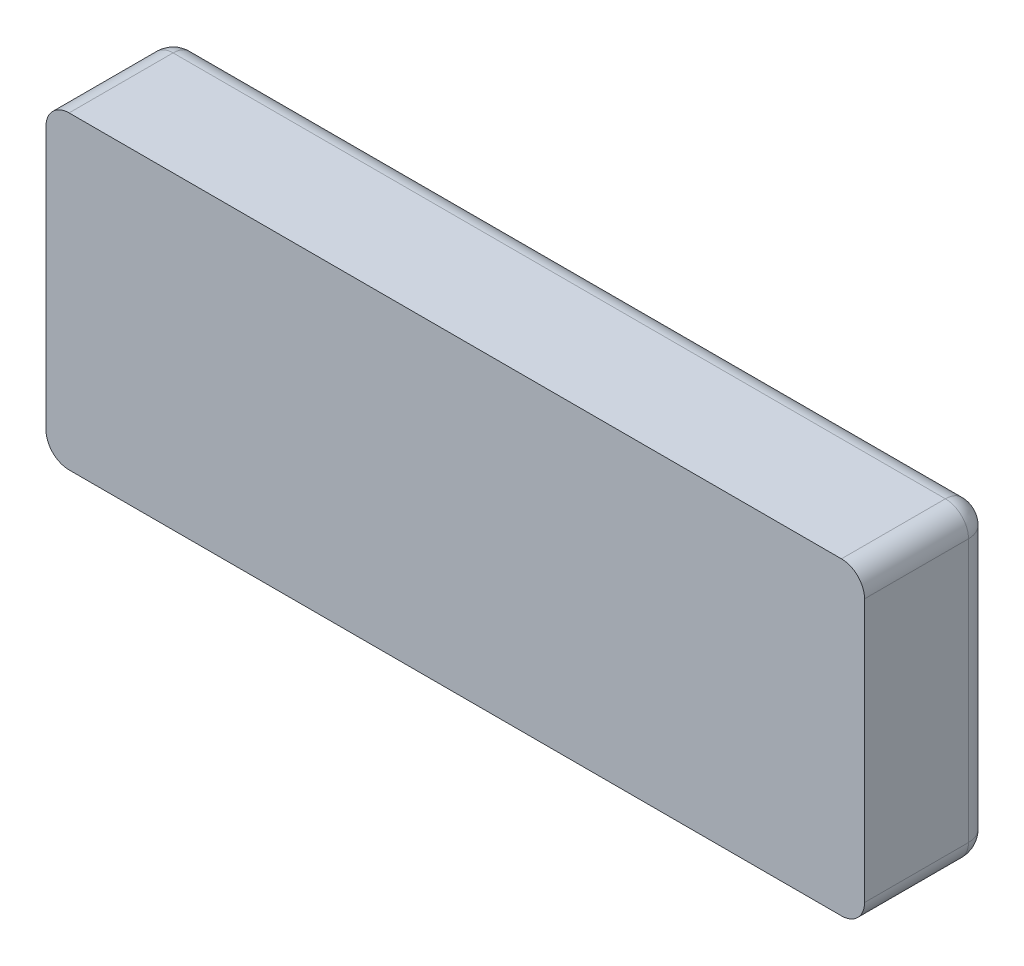
ISO-10303-21;
HEADER;
FILE_DESCRIPTION(('STEP AP214'),'2;1');
FILE_NAME('part.step','',(''),(''),'','','');
FILE_SCHEMA(('AUTOMOTIVE_DESIGN { 1 0 10303 214 1 1 1 1 }'));
ENDSEC;
DATA;
#1=APPLICATION_CONTEXT('core data for automotive mechanical design processes');
#2=APPLICATION_PROTOCOL_DEFINITION('international standard','automotive_design',2000,#1);
#3=PRODUCT_CONTEXT('',#1,'mechanical');
#4=PRODUCT('Part','Part','',(#3));
#5=PRODUCT_RELATED_PRODUCT_CATEGORY('part','',(#4));
#6=PRODUCT_DEFINITION_FORMATION('','',#4);
#7=PRODUCT_DEFINITION_CONTEXT('part definition',#1,'design');
#8=PRODUCT_DEFINITION('design','',#6,#7);
#9=PRODUCT_DEFINITION_SHAPE('','',#8);
#10=(LENGTH_UNIT() NAMED_UNIT(*) SI_UNIT(.MILLI.,.METRE.));
#11=(NAMED_UNIT(*) PLANE_ANGLE_UNIT() SI_UNIT($,.RADIAN.));
#12=(NAMED_UNIT(*) SI_UNIT($,.STERADIAN.) SOLID_ANGLE_UNIT());
#13=UNCERTAINTY_MEASURE_WITH_UNIT(LENGTH_MEASURE(1.E-05),#10,'distance_accuracy_value','');
#14=(GEOMETRIC_REPRESENTATION_CONTEXT(3) GLOBAL_UNCERTAINTY_ASSIGNED_CONTEXT((#13)) GLOBAL_UNIT_ASSIGNED_CONTEXT((#10,
#11,#12)) REPRESENTATION_CONTEXT('',''));
#15=CARTESIAN_POINT('',(0.,0.,0.));
#16=DIRECTION('',(0.,0.,1.));
#17=DIRECTION('',(1.,0.,0.));
#18=AXIS2_PLACEMENT_3D('',#15,#16,#17);
#19=CARTESIAN_POINT('',(45.,-17.,13.97));
#20=DIRECTION('',(-1.,0.,0.));
#21=DIRECTION('',(0.,0.,1.));
#22=AXIS2_PLACEMENT_3D('',#19,#20,#21);
#23=PLANE('',#22);
#24=DIRECTION('',(0.,1.,0.));
#25=VECTOR('',#24,1.);
#26=CARTESIAN_POINT('',(45.,-17.,13.97));
#27=LINE('',#26,#25);
#28=CARTESIAN_POINT('',(45.,-14.46,13.97));
#29=VERTEX_POINT('',#28);
#30=CARTESIAN_POINT('',(45.,14.46,13.97));
#31=VERTEX_POINT('',#30);
#32=EDGE_CURVE('E117',#29,#31,#27,.T.);
#33=ORIENTED_EDGE('',*,*,#32,.F.);
#34=DIRECTION('',(0.,0.,-1.));
#35=VECTOR('',#34,1.);
#36=CARTESIAN_POINT('',(45.,-14.46,13.97));
#37=LINE('',#36,#35);
#38=CARTESIAN_POINT('',(45.,-14.46,2.54));
#39=VERTEX_POINT('',#38);
#40=EDGE_CURVE('E50',#29,#39,#37,.T.);
#41=ORIENTED_EDGE('',*,*,#40,.T.);
#42=DIRECTION('',(0.,1.,0.));
#43=VECTOR('',#42,1.);
#44=CARTESIAN_POINT('',(45.,17.,2.54));
#45=LINE('',#44,#43);
#46=CARTESIAN_POINT('',(45.,14.46,2.54));
#47=VERTEX_POINT('',#46);
#48=EDGE_CURVE('E55',#39,#47,#45,.T.);
#49=ORIENTED_EDGE('',*,*,#48,.T.);
#50=DIRECTION('',(0.,0.,-1.));
#51=VECTOR('',#50,1.);
#52=CARTESIAN_POINT('',(45.,14.46,13.97));
#53=LINE('',#52,#51);
#54=EDGE_CURVE('E165',#47,#31,#53,.F.);
#55=ORIENTED_EDGE('',*,*,#54,.T.);
#56=EDGE_LOOP('',(#33,#41,#49,#55));
#57=FACE_BOUND('',#56,.T.);
#58=ADVANCED_FACE('F33',(#57),#23,.F.);
#59=CARTESIAN_POINT('',(-45.,17.,13.97));
#60=DIRECTION('',(0.,-1.,0.));
#61=DIRECTION('',(0.,0.,-1.));
#62=AXIS2_PLACEMENT_3D('',#59,#60,#61);
#63=PLANE('',#62);
#64=DIRECTION('',(-1.,0.,0.));
#65=VECTOR('',#64,1.);
#66=CARTESIAN_POINT('',(-45.,17.,2.54));
#67=LINE('',#66,#65);
#68=CARTESIAN_POINT('',(42.46,17.,2.54));
#69=VERTEX_POINT('',#68);
#70=CARTESIAN_POINT('',(-42.46,17.,2.54));
#71=VERTEX_POINT('',#70);
#72=EDGE_CURVE('E135',#69,#71,#67,.T.);
#73=ORIENTED_EDGE('',*,*,#72,.T.);
#74=DIRECTION('',(0.,0.,-1.));
#75=VECTOR('',#74,1.);
#76=CARTESIAN_POINT('',(-42.46,17.,13.97));
#77=LINE('',#76,#75);
#78=CARTESIAN_POINT('',(-42.46,17.,13.97));
#79=VERTEX_POINT('',#78);
#80=EDGE_CURVE('E128',#71,#79,#77,.F.);
#81=ORIENTED_EDGE('',*,*,#80,.T.);
#82=DIRECTION('',(-1.,0.,0.));
#83=VECTOR('',#82,1.);
#84=CARTESIAN_POINT('',(-45.,17.,13.97));
#85=LINE('',#84,#83);
#86=CARTESIAN_POINT('',(42.46,17.,13.97));
#87=VERTEX_POINT('',#86);
#88=EDGE_CURVE('E115',#87,#79,#85,.T.);
#89=ORIENTED_EDGE('',*,*,#88,.F.);
#90=DIRECTION('',(0.,0.,-1.));
#91=VECTOR('',#90,1.);
#92=CARTESIAN_POINT('',(42.46,17.,13.97));
#93=LINE('',#92,#91);
#94=EDGE_CURVE('E125',#87,#69,#93,.T.);
#95=ORIENTED_EDGE('',*,*,#94,.T.);
#96=EDGE_LOOP('',(#73,#81,#89,#95));
#97=FACE_BOUND('',#96,.T.);
#98=ADVANCED_FACE('F124',(#97),#63,.F.);
#99=CARTESIAN_POINT('',(-45.,-17.,13.97));
#100=DIRECTION('',(1.,0.,0.));
#101=DIRECTION('',(0.,0.,-1.));
#102=AXIS2_PLACEMENT_3D('',#99,#100,#101);
#103=PLANE('',#102);
#104=DIRECTION('',(0.,-1.,0.));
#105=VECTOR('',#104,1.);
#106=CARTESIAN_POINT('',(-45.,-17.,13.97));
#107=LINE('',#106,#105);
#108=CARTESIAN_POINT('',(-45.,14.46,13.97));
#109=VERTEX_POINT('',#108);
#110=CARTESIAN_POINT('',(-45.,-14.46,13.97));
#111=VERTEX_POINT('',#110);
#112=EDGE_CURVE('E129',#109,#111,#107,.T.);
#113=ORIENTED_EDGE('',*,*,#112,.F.);
#114=DIRECTION('',(0.,0.,-1.));
#115=VECTOR('',#114,1.);
#116=CARTESIAN_POINT('',(-45.,14.46,13.97));
#117=LINE('',#116,#115);
#118=CARTESIAN_POINT('',(-45.,14.46,2.54));
#119=VERTEX_POINT('',#118);
#120=EDGE_CURVE('E157',#109,#119,#117,.T.);
#121=ORIENTED_EDGE('',*,*,#120,.T.);
#122=DIRECTION('',(0.,-1.,0.));
#123=VECTOR('',#122,1.);
#124=CARTESIAN_POINT('',(-45.,-17.,2.54));
#125=LINE('',#124,#123);
#126=CARTESIAN_POINT('',(-45.,-14.46,2.54));
#127=VERTEX_POINT('',#126);
#128=EDGE_CURVE('E155',#119,#127,#125,.T.);
#129=ORIENTED_EDGE('',*,*,#128,.T.);
#130=DIRECTION('',(0.,0.,-1.));
#131=VECTOR('',#130,1.);
#132=CARTESIAN_POINT('',(-45.,-14.46,13.97));
#133=LINE('',#132,#131);
#134=EDGE_CURVE('E153',#127,#111,#133,.F.);
#135=ORIENTED_EDGE('',*,*,#134,.T.);
#136=EDGE_LOOP('',(#113,#121,#129,#135));
#137=FACE_BOUND('',#136,.T.);
#138=ADVANCED_FACE('F248',(#137),#103,.F.);
#139=CARTESIAN_POINT('',(-45.,-17.,13.97));
#140=DIRECTION('',(0.,1.,0.));
#141=DIRECTION('',(0.,0.,1.));
#142=AXIS2_PLACEMENT_3D('',#139,#140,#141);
#143=PLANE('',#142);
#144=DIRECTION('',(1.,0.,0.));
#145=VECTOR('',#144,1.);
#146=CARTESIAN_POINT('',(-45.,-17.,13.97));
#147=LINE('',#146,#145);
#148=CARTESIAN_POINT('',(-42.46,-17.,13.97));
#149=VERTEX_POINT('',#148);
#150=CARTESIAN_POINT('',(42.46,-17.,13.97));
#151=VERTEX_POINT('',#150);
#152=EDGE_CURVE('E136',#149,#151,#147,.T.);
#153=ORIENTED_EDGE('',*,*,#152,.F.);
#154=DIRECTION('',(0.,0.,-1.));
#155=VECTOR('',#154,1.);
#156=CARTESIAN_POINT('',(-42.46,-17.,13.97));
#157=LINE('',#156,#155);
#158=CARTESIAN_POINT('',(-42.46,-17.,2.54));
#159=VERTEX_POINT('',#158);
#160=EDGE_CURVE('E163',#149,#159,#157,.T.);
#161=ORIENTED_EDGE('',*,*,#160,.T.);
#162=DIRECTION('',(1.,0.,0.));
#163=VECTOR('',#162,1.);
#164=CARTESIAN_POINT('',(45.,-17.,2.54));
#165=LINE('',#164,#163);
#166=CARTESIAN_POINT('',(42.46,-17.,2.54));
#167=VERTEX_POINT('',#166);
#168=EDGE_CURVE('E161',#159,#167,#165,.T.);
#169=ORIENTED_EDGE('',*,*,#168,.T.);
#170=DIRECTION('',(0.,0.,-1.));
#171=VECTOR('',#170,1.);
#172=CARTESIAN_POINT('',(42.46,-17.,13.97));
#173=LINE('',#172,#171);
#174=EDGE_CURVE('E159',#167,#151,#173,.F.);
#175=ORIENTED_EDGE('',*,*,#174,.T.);
#176=EDGE_LOOP('',(#153,#161,#169,#175));
#177=FACE_BOUND('',#176,.T.);
#178=ADVANCED_FACE('F216',(#177),#143,.F.);
#179=CARTESIAN_POINT('',(0.,0.,13.97));
#180=DIRECTION('',(0.,0.,-1.));
#181=DIRECTION('',(-1.,0.,0.));
#182=AXIS2_PLACEMENT_3D('',#179,#180,#181);
#183=PLANE('',#182);
#184=ORIENTED_EDGE('',*,*,#88,.T.);
#185=CARTESIAN_POINT('',(-42.46,14.46,13.97));
#186=DIRECTION('',(0.,0.,-1.));
#187=DIRECTION('',(-1.,0.,0.));
#188=AXIS2_PLACEMENT_3D('',#185,#186,#187);
#189=CIRCLE('',#188,2.54);
#190=EDGE_CURVE('E11',#79,#109,#189,.F.);
#191=ORIENTED_EDGE('',*,*,#190,.T.);
#192=ORIENTED_EDGE('',*,*,#112,.T.);
#193=CARTESIAN_POINT('',(-42.46,-14.46,13.97));
#194=DIRECTION('',(0.,0.,-1.));
#195=DIRECTION('',(-1.,0.,0.));
#196=AXIS2_PLACEMENT_3D('',#193,#194,#195);
#197=CIRCLE('',#196,2.54);
#198=EDGE_CURVE('E42',#111,#149,#197,.F.);
#199=ORIENTED_EDGE('',*,*,#198,.T.);
#200=ORIENTED_EDGE('',*,*,#152,.T.);
#201=CARTESIAN_POINT('',(42.46,-14.46,13.97));
#202=DIRECTION('',(0.,0.,-1.));
#203=DIRECTION('',(-1.,0.,0.));
#204=AXIS2_PLACEMENT_3D('',#201,#202,#203);
#205=CIRCLE('',#204,2.54);
#206=EDGE_CURVE('E120',#151,#29,#205,.F.);
#207=ORIENTED_EDGE('',*,*,#206,.T.);
#208=ORIENTED_EDGE('',*,*,#32,.T.);
#209=CARTESIAN_POINT('',(42.46,14.46,13.97));
#210=DIRECTION('',(0.,0.,-1.));
#211=DIRECTION('',(-1.,0.,0.));
#212=AXIS2_PLACEMENT_3D('',#209,#210,#211);
#213=CIRCLE('',#212,2.54);
#214=EDGE_CURVE('E112',#31,#87,#213,.F.);
#215=ORIENTED_EDGE('',*,*,#214,.T.);
#216=EDGE_LOOP('',(#184,#191,#192,#199,#200,#207,#208,#215));
#217=FACE_BOUND('',#216,.T.);
#218=ADVANCED_FACE('F114',(#217),#183,.F.);
#219=CARTESIAN_POINT('',(0.,0.,0.));
#220=DIRECTION('',(0.,0.,-1.));
#221=DIRECTION('',(-1.,0.,0.));
#222=AXIS2_PLACEMENT_3D('',#219,#220,#221);
#223=PLANE('',#222);
#224=DIRECTION('',(0.,-1.,0.));
#225=VECTOR('',#224,1.);
#226=CARTESIAN_POINT('',(-42.46,17.,0.));
#227=LINE('',#226,#225);
#228=CARTESIAN_POINT('',(-42.46,-14.46,0.));
#229=VERTEX_POINT('',#228);
#230=CARTESIAN_POINT('',(-42.46,14.46,0.));
#231=VERTEX_POINT('',#230);
#232=EDGE_CURVE('E148',#229,#231,#227,.F.);
#233=ORIENTED_EDGE('',*,*,#232,.T.);
#234=DIRECTION('',(-1.,0.,0.));
#235=VECTOR('',#234,1.);
#236=CARTESIAN_POINT('',(45.,14.46,0.));
#237=LINE('',#236,#235);
#238=CARTESIAN_POINT('',(42.46,14.46,0.));
#239=VERTEX_POINT('',#238);
#240=EDGE_CURVE('E150',#231,#239,#237,.F.);
#241=ORIENTED_EDGE('',*,*,#240,.T.);
#242=DIRECTION('',(0.,1.,0.));
#243=VECTOR('',#242,1.);
#244=CARTESIAN_POINT('',(42.46,-17.,0.));
#245=LINE('',#244,#243);
#246=CARTESIAN_POINT('',(42.46,-14.46,0.));
#247=VERTEX_POINT('',#246);
#248=EDGE_CURVE('E144',#239,#247,#245,.F.);
#249=ORIENTED_EDGE('',*,*,#248,.T.);
#250=DIRECTION('',(1.,0.,0.));
#251=VECTOR('',#250,1.);
#252=CARTESIAN_POINT('',(-45.,-14.46,0.));
#253=LINE('',#252,#251);
#254=EDGE_CURVE('E146',#247,#229,#253,.F.);
#255=ORIENTED_EDGE('',*,*,#254,.T.);
#256=EDGE_LOOP('',(#233,#241,#249,#255));
#257=FACE_BOUND('',#256,.T.);
#258=ADVANCED_FACE('F224',(#257),#223,.T.);
#259=CARTESIAN_POINT('',(42.46,-14.46,13.97));
#260=DIRECTION('',(0.,0.,-1.));
#261=DIRECTION('',(-1.,0.,0.));
#262=AXIS2_PLACEMENT_3D('',#259,#260,#261);
#263=CYLINDRICAL_SURFACE('',#262,2.54);
#264=ORIENTED_EDGE('',*,*,#206,.F.);
#265=ORIENTED_EDGE('',*,*,#174,.F.);
#266=CARTESIAN_POINT('',(42.46,-14.46,2.54));
#267=DIRECTION('',(0.,0.,-1.));
#268=DIRECTION('',(-1.,0.,0.));
#269=AXIS2_PLACEMENT_3D('',#266,#267,#268);
#270=CIRCLE('',#269,2.54);
#271=EDGE_CURVE('E196',#39,#167,#270,.T.);
#272=ORIENTED_EDGE('',*,*,#271,.F.);
#273=ORIENTED_EDGE('',*,*,#40,.F.);
#274=EDGE_LOOP('',(#264,#265,#272,#273));
#275=FACE_BOUND('',#274,.T.);
#276=ADVANCED_FACE('F35',(#275),#263,.T.);
#277=CARTESIAN_POINT('',(-42.46,-14.46,13.97));
#278=DIRECTION('',(0.,0.,-1.));
#279=DIRECTION('',(-1.,0.,0.));
#280=AXIS2_PLACEMENT_3D('',#277,#278,#279);
#281=CYLINDRICAL_SURFACE('',#280,2.54);
#282=ORIENTED_EDGE('',*,*,#198,.F.);
#283=ORIENTED_EDGE('',*,*,#134,.F.);
#284=CARTESIAN_POINT('',(-42.46,-14.46,2.54));
#285=DIRECTION('',(0.,0.,-1.));
#286=DIRECTION('',(-1.,0.,0.));
#287=AXIS2_PLACEMENT_3D('',#284,#285,#286);
#288=CIRCLE('',#287,2.54);
#289=EDGE_CURVE('E194',#159,#127,#288,.T.);
#290=ORIENTED_EDGE('',*,*,#289,.F.);
#291=ORIENTED_EDGE('',*,*,#160,.F.);
#292=EDGE_LOOP('',(#282,#283,#290,#291));
#293=FACE_BOUND('',#292,.T.);
#294=ADVANCED_FACE('F212',(#293),#281,.T.);
#295=CARTESIAN_POINT('',(-45.,-14.46,2.54));
#296=DIRECTION('',(-1.,0.,0.));
#297=DIRECTION('',(0.,0.,1.));
#298=AXIS2_PLACEMENT_3D('',#295,#296,#297);
#299=CYLINDRICAL_SURFACE('',#298,2.54);
#300=CARTESIAN_POINT('',(42.46,-14.46,2.54));
#301=DIRECTION('',(1.,0.,0.));
#302=DIRECTION('',(0.,0.,-1.));
#303=AXIS2_PLACEMENT_3D('',#300,#301,#302);
#304=CIRCLE('',#303,2.54);
#305=EDGE_CURVE('E37',#167,#247,#304,.T.);
#306=ORIENTED_EDGE('',*,*,#305,.F.);
#307=ORIENTED_EDGE('',*,*,#168,.F.);
#308=CARTESIAN_POINT('',(-42.46,-14.46,2.54));
#309=DIRECTION('',(-1.,0.,0.));
#310=DIRECTION('',(0.,0.,1.));
#311=AXIS2_PLACEMENT_3D('',#308,#309,#310);
#312=CIRCLE('',#311,2.54);
#313=EDGE_CURVE('E191',#229,#159,#312,.T.);
#314=ORIENTED_EDGE('',*,*,#313,.F.);
#315=ORIENTED_EDGE('',*,*,#254,.F.);
#316=EDGE_LOOP('',(#306,#307,#314,#315));
#317=FACE_BOUND('',#316,.T.);
#318=ADVANCED_FACE('F220',(#317),#299,.T.);
#319=CARTESIAN_POINT('',(42.46,-14.46,2.54));
#320=DIRECTION('',(0.,0.,1.));
#321=DIRECTION('',(1.,0.,0.));
#322=AXIS2_PLACEMENT_3D('',#319,#320,#321);
#323=SPHERICAL_SURFACE('',#322,2.54);
#324=ORIENTED_EDGE('',*,*,#271,.T.);
#325=ORIENTED_EDGE('',*,*,#305,.T.);
#326=CARTESIAN_POINT('',(42.46,-14.46,2.54));
#327=DIRECTION('',(0.,-1.,0.));
#328=DIRECTION('',(0.,0.,-1.));
#329=AXIS2_PLACEMENT_3D('',#326,#327,#328);
#330=CIRCLE('',#329,2.54);
#331=EDGE_CURVE('E188',#39,#247,#330,.F.);
#332=ORIENTED_EDGE('',*,*,#331,.F.);
#333=EDGE_LOOP('',(#324,#325,#332));
#334=FACE_BOUND('',#333,.T.);
#335=ADVANCED_FACE('F232',(#334),#323,.T.);
#336=CARTESIAN_POINT('',(-42.46,-14.46,2.54));
#337=DIRECTION('',(0.,0.,1.));
#338=DIRECTION('',(1.,0.,0.));
#339=AXIS2_PLACEMENT_3D('',#336,#337,#338);
#340=SPHERICAL_SURFACE('',#339,2.54);
#341=ORIENTED_EDGE('',*,*,#313,.T.);
#342=ORIENTED_EDGE('',*,*,#289,.T.);
#343=CARTESIAN_POINT('',(-42.46,-14.46,2.54));
#344=DIRECTION('',(0.,-1.,0.));
#345=DIRECTION('',(0.,0.,-1.));
#346=AXIS2_PLACEMENT_3D('',#343,#344,#345);
#347=CIRCLE('',#346,2.54);
#348=EDGE_CURVE('E185',#229,#127,#347,.F.);
#349=ORIENTED_EDGE('',*,*,#348,.F.);
#350=EDGE_LOOP('',(#341,#342,#349));
#351=FACE_BOUND('',#350,.T.);
#352=ADVANCED_FACE('F234',(#351),#340,.T.);
#353=CARTESIAN_POINT('',(42.46,-17.,2.54));
#354=DIRECTION('',(0.,-1.,0.));
#355=DIRECTION('',(0.,0.,-1.));
#356=AXIS2_PLACEMENT_3D('',#353,#354,#355);
#357=CYLINDRICAL_SURFACE('',#356,2.54);
#358=ORIENTED_EDGE('',*,*,#331,.T.);
#359=ORIENTED_EDGE('',*,*,#248,.F.);
#360=CARTESIAN_POINT('',(42.46,14.46,2.54));
#361=DIRECTION('',(0.,1.,0.));
#362=DIRECTION('',(0.,0.,1.));
#363=AXIS2_PLACEMENT_3D('',#360,#361,#362);
#364=CIRCLE('',#363,2.54);
#365=EDGE_CURVE('E182',#47,#239,#364,.T.);
#366=ORIENTED_EDGE('',*,*,#365,.F.);
#367=ORIENTED_EDGE('',*,*,#48,.F.);
#368=EDGE_LOOP('',(#358,#359,#366,#367));
#369=FACE_BOUND('',#368,.T.);
#370=ADVANCED_FACE('F231',(#369),#357,.T.);
#371=CARTESIAN_POINT('',(42.46,14.46,13.97));
#372=DIRECTION('',(0.,0.,-1.));
#373=DIRECTION('',(-1.,0.,0.));
#374=AXIS2_PLACEMENT_3D('',#371,#372,#373);
#375=CYLINDRICAL_SURFACE('',#374,2.54);
#376=ORIENTED_EDGE('',*,*,#214,.F.);
#377=ORIENTED_EDGE('',*,*,#54,.F.);
#378=CARTESIAN_POINT('',(42.46,14.46,2.54));
#379=DIRECTION('',(0.,0.,-1.));
#380=DIRECTION('',(-1.,0.,0.));
#381=AXIS2_PLACEMENT_3D('',#378,#379,#380);
#382=CIRCLE('',#381,2.54);
#383=EDGE_CURVE('E133',#69,#47,#382,.T.);
#384=ORIENTED_EDGE('',*,*,#383,.F.);
#385=ORIENTED_EDGE('',*,*,#94,.F.);
#386=EDGE_LOOP('',(#376,#377,#384,#385));
#387=FACE_BOUND('',#386,.T.);
#388=ADVANCED_FACE('F131',(#387),#375,.T.);
#389=CARTESIAN_POINT('',(-42.46,14.46,13.97));
#390=DIRECTION('',(0.,0.,-1.));
#391=DIRECTION('',(-1.,0.,0.));
#392=AXIS2_PLACEMENT_3D('',#389,#390,#391);
#393=CYLINDRICAL_SURFACE('',#392,2.54);
#394=ORIENTED_EDGE('',*,*,#190,.F.);
#395=ORIENTED_EDGE('',*,*,#80,.F.);
#396=CARTESIAN_POINT('',(-42.46,14.46,2.54));
#397=DIRECTION('',(0.,0.,-1.));
#398=DIRECTION('',(-1.,0.,0.));
#399=AXIS2_PLACEMENT_3D('',#396,#397,#398);
#400=CIRCLE('',#399,2.54);
#401=EDGE_CURVE('E178',#119,#71,#400,.T.);
#402=ORIENTED_EDGE('',*,*,#401,.F.);
#403=ORIENTED_EDGE('',*,*,#120,.F.);
#404=EDGE_LOOP('',(#394,#395,#402,#403));
#405=FACE_BOUND('',#404,.T.);
#406=ADVANCED_FACE('F267',(#405),#393,.T.);
#407=CARTESIAN_POINT('',(-42.46,-17.,2.54));
#408=DIRECTION('',(0.,1.,0.));
#409=DIRECTION('',(0.,0.,1.));
#410=AXIS2_PLACEMENT_3D('',#407,#408,#409);
#411=CYLINDRICAL_SURFACE('',#410,2.54);
#412=ORIENTED_EDGE('',*,*,#348,.T.);
#413=ORIENTED_EDGE('',*,*,#128,.F.);
#414=CARTESIAN_POINT('',(-42.46,14.46,2.54));
#415=DIRECTION('',(0.,1.,0.));
#416=DIRECTION('',(0.,0.,1.));
#417=AXIS2_PLACEMENT_3D('',#414,#415,#416);
#418=CIRCLE('',#417,2.54);
#419=EDGE_CURVE('E175',#231,#119,#418,.T.);
#420=ORIENTED_EDGE('',*,*,#419,.F.);
#421=ORIENTED_EDGE('',*,*,#232,.F.);
#422=EDGE_LOOP('',(#412,#413,#420,#421));
#423=FACE_BOUND('',#422,.T.);
#424=ADVANCED_FACE('F263',(#423),#411,.T.);
#425=CARTESIAN_POINT('',(42.46,14.46,2.54));
#426=DIRECTION('',(0.,0.,1.));
#427=DIRECTION('',(1.,0.,0.));
#428=AXIS2_PLACEMENT_3D('',#425,#426,#427);
#429=SPHERICAL_SURFACE('',#428,2.54);
#430=ORIENTED_EDGE('',*,*,#383,.T.);
#431=ORIENTED_EDGE('',*,*,#365,.T.);
#432=CARTESIAN_POINT('',(42.46,14.46,2.54));
#433=DIRECTION('',(1.,0.,0.));
#434=DIRECTION('',(0.,0.,-1.));
#435=AXIS2_PLACEMENT_3D('',#432,#433,#434);
#436=CIRCLE('',#435,2.54);
#437=EDGE_CURVE('E173',#69,#239,#436,.F.);
#438=ORIENTED_EDGE('',*,*,#437,.F.);
#439=EDGE_LOOP('',(#430,#431,#438));
#440=FACE_BOUND('',#439,.T.);
#441=ADVANCED_FACE('F259',(#440),#429,.T.);
#442=CARTESIAN_POINT('',(-42.46,14.46,2.54));
#443=DIRECTION('',(0.,0.,1.));
#444=DIRECTION('',(1.,0.,0.));
#445=AXIS2_PLACEMENT_3D('',#442,#443,#444);
#446=SPHERICAL_SURFACE('',#445,2.54);
#447=ORIENTED_EDGE('',*,*,#419,.T.);
#448=ORIENTED_EDGE('',*,*,#401,.T.);
#449=CARTESIAN_POINT('',(-42.46,14.46,2.54));
#450=DIRECTION('',(-1.,0.,0.));
#451=DIRECTION('',(0.,0.,1.));
#452=AXIS2_PLACEMENT_3D('',#449,#450,#451);
#453=CIRCLE('',#452,2.54);
#454=EDGE_CURVE('E171',#231,#71,#453,.F.);
#455=ORIENTED_EDGE('',*,*,#454,.F.);
#456=EDGE_LOOP('',(#447,#448,#455));
#457=FACE_BOUND('',#456,.T.);
#458=ADVANCED_FACE('F255',(#457),#446,.T.);
#459=CARTESIAN_POINT('',(-45.,14.46,2.54));
#460=DIRECTION('',(1.,0.,0.));
#461=DIRECTION('',(0.,0.,-1.));
#462=AXIS2_PLACEMENT_3D('',#459,#460,#461);
#463=CYLINDRICAL_SURFACE('',#462,2.54);
#464=ORIENTED_EDGE('',*,*,#437,.T.);
#465=ORIENTED_EDGE('',*,*,#240,.F.);
#466=ORIENTED_EDGE('',*,*,#454,.T.);
#467=ORIENTED_EDGE('',*,*,#72,.F.);
#468=EDGE_LOOP('',(#464,#465,#466,#467));
#469=FACE_BOUND('',#468,.T.);
#470=ADVANCED_FACE('F252',(#469),#463,.T.);
#471=CLOSED_SHELL('',(#58,#98,#138,#178,#218,#258,#276,#294,#318,#335,#352,#370,#388,#406,#424,
#441,#458,#470));
#472=MANIFOLD_SOLID_BREP('B2',#471);
#473=ADVANCED_BREP_SHAPE_REPRESENTATION('',(#18,#472),#14);
#474=SHAPE_DEFINITION_REPRESENTATION(#9,#473);
ENDSEC;
END-ISO-10303-21;
